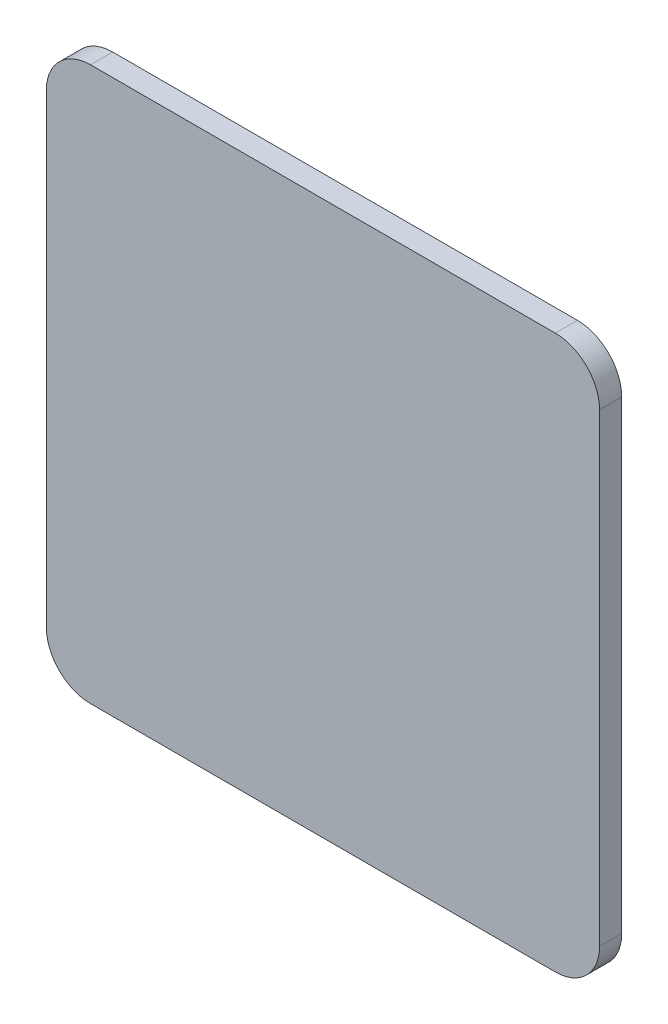
ISO-10303-21;
HEADER;
FILE_DESCRIPTION(('STEP AP214'),'2;1');
FILE_NAME('part.step','',(''),(''),'','','');
FILE_SCHEMA(('AUTOMOTIVE_DESIGN { 1 0 10303 214 1 1 1 1 }'));
ENDSEC;
DATA;
#1=APPLICATION_CONTEXT('core data for automotive mechanical design processes');
#2=APPLICATION_PROTOCOL_DEFINITION('international standard','automotive_design',2000,#1);
#3=PRODUCT_CONTEXT('',#1,'mechanical');
#4=PRODUCT('Part','Part','',(#3));
#5=PRODUCT_RELATED_PRODUCT_CATEGORY('part','',(#4));
#6=PRODUCT_DEFINITION_FORMATION('','',#4);
#7=PRODUCT_DEFINITION_CONTEXT('part definition',#1,'design');
#8=PRODUCT_DEFINITION('design','',#6,#7);
#9=PRODUCT_DEFINITION_SHAPE('','',#8);
#10=(LENGTH_UNIT() NAMED_UNIT(*) SI_UNIT(.MILLI.,.METRE.));
#11=(NAMED_UNIT(*) PLANE_ANGLE_UNIT() SI_UNIT($,.RADIAN.));
#12=(NAMED_UNIT(*) SI_UNIT($,.STERADIAN.) SOLID_ANGLE_UNIT());
#13=UNCERTAINTY_MEASURE_WITH_UNIT(LENGTH_MEASURE(1.E-05),#10,'distance_accuracy_value','');
#14=(GEOMETRIC_REPRESENTATION_CONTEXT(3) GLOBAL_UNCERTAINTY_ASSIGNED_CONTEXT((#13)) GLOBAL_UNIT_ASSIGNED_CONTEXT((#10,
#11,#12)) REPRESENTATION_CONTEXT('',''));
#15=CARTESIAN_POINT('',(0.,0.,0.));
#16=DIRECTION('',(0.,0.,1.));
#17=DIRECTION('',(1.,0.,0.));
#18=AXIS2_PLACEMENT_3D('',#15,#16,#17);
#19=CARTESIAN_POINT('',(0.,63.5,5.08));
#20=DIRECTION('',(0.,-1.,0.));
#21=DIRECTION('',(1.,0.,0.));
#22=AXIS2_PLACEMENT_3D('',#19,#20,#21);
#23=PLANE('',#22);
#24=DIRECTION('',(-1.,0.,0.));
#25=VECTOR('',#24,1.);
#26=CARTESIAN_POINT('',(0.,63.5,0.));
#27=LINE('',#26,#25);
#28=CARTESIAN_POINT('',(53.3399999999999,63.5,0.));
#29=VERTEX_POINT('',#28);
#30=CARTESIAN_POINT('',(-53.3399999999999,63.5,0.));
#31=VERTEX_POINT('',#30);
#32=EDGE_CURVE('E133',#29,#31,#27,.T.);
#33=ORIENTED_EDGE('',*,*,#32,.T.);
#34=DIRECTION('',(0.,0.,-1.));
#35=VECTOR('',#34,1.);
#36=CARTESIAN_POINT('',(-53.3399999999999,63.5,5.08));
#37=LINE('',#36,#35);
#38=CARTESIAN_POINT('',(-53.3399999999999,63.5,5.08));
#39=VERTEX_POINT('',#38);
#40=EDGE_CURVE('E11',#39,#31,#37,.T.);
#41=ORIENTED_EDGE('',*,*,#40,.F.);
#42=DIRECTION('',(-1.,0.,0.));
#43=VECTOR('',#42,1.);
#44=CARTESIAN_POINT('',(0.,63.5,5.08));
#45=LINE('',#44,#43);
#46=CARTESIAN_POINT('',(53.3399999999999,63.5,5.08));
#47=VERTEX_POINT('',#46);
#48=EDGE_CURVE('E150',#47,#39,#45,.T.);
#49=ORIENTED_EDGE('',*,*,#48,.F.);
#50=DIRECTION('',(0.,0.,-1.));
#51=VECTOR('',#50,1.);
#52=CARTESIAN_POINT('',(53.3399999999999,63.5,5.08));
#53=LINE('',#52,#51);
#54=EDGE_CURVE('E129',#47,#29,#53,.T.);
#55=ORIENTED_EDGE('',*,*,#54,.T.);
#56=EDGE_LOOP('',(#33,#41,#49,#55));
#57=FACE_BOUND('',#56,.T.);
#58=ADVANCED_FACE('F39',(#57),#23,.F.);
#59=CARTESIAN_POINT('',(-53.34,53.34,5.08));
#60=DIRECTION('',(0.,0.,-1.));
#61=DIRECTION('',(-1.,0.,0.));
#62=AXIS2_PLACEMENT_3D('',#59,#60,#61);
#63=CYLINDRICAL_SURFACE('',#62,10.16);
#64=CARTESIAN_POINT('',(-53.34,53.34,0.));
#65=DIRECTION('',(0.,0.,1.));
#66=DIRECTION('',(1.,0.,0.));
#67=AXIS2_PLACEMENT_3D('',#64,#65,#66);
#68=CIRCLE('',#67,10.16);
#69=CARTESIAN_POINT('',(-63.5,53.3399999999999,0.));
#70=VERTEX_POINT('',#69);
#71=EDGE_CURVE('E136',#31,#70,#68,.T.);
#72=ORIENTED_EDGE('',*,*,#71,.T.);
#73=DIRECTION('',(0.,0.,-1.));
#74=VECTOR('',#73,1.);
#75=CARTESIAN_POINT('',(-63.5,53.3399999999999,5.08));
#76=LINE('',#75,#74);
#77=CARTESIAN_POINT('',(-63.5,53.3399999999999,5.08));
#78=VERTEX_POINT('',#77);
#79=EDGE_CURVE('E47',#78,#70,#76,.T.);
#80=ORIENTED_EDGE('',*,*,#79,.F.);
#81=CARTESIAN_POINT('',(-53.34,53.34,5.08));
#82=DIRECTION('',(0.,0.,1.));
#83=DIRECTION('',(1.,0.,0.));
#84=AXIS2_PLACEMENT_3D('',#81,#82,#83);
#85=CIRCLE('',#84,10.16);
#86=EDGE_CURVE('E94',#39,#78,#85,.T.);
#87=ORIENTED_EDGE('',*,*,#86,.F.);
#88=ORIENTED_EDGE('',*,*,#40,.T.);
#89=EDGE_LOOP('',(#72,#80,#87,#88));
#90=FACE_BOUND('',#89,.T.);
#91=ADVANCED_FACE('F182',(#90),#63,.T.);
#92=CARTESIAN_POINT('',(-63.5,0.,5.08));
#93=DIRECTION('',(1.,0.,0.));
#94=DIRECTION('',(0.,1.,0.));
#95=AXIS2_PLACEMENT_3D('',#92,#93,#94);
#96=PLANE('',#95);
#97=DIRECTION('',(0.,-1.,0.));
#98=VECTOR('',#97,1.);
#99=CARTESIAN_POINT('',(-63.5,0.,0.));
#100=LINE('',#99,#98);
#101=CARTESIAN_POINT('',(-63.5,-53.34,0.));
#102=VERTEX_POINT('',#101);
#103=EDGE_CURVE('E138',#70,#102,#100,.T.);
#104=ORIENTED_EDGE('',*,*,#103,.T.);
#105=DIRECTION('',(0.,0.,-1.));
#106=VECTOR('',#105,1.);
#107=CARTESIAN_POINT('',(-63.5,-53.34,5.08));
#108=LINE('',#107,#106);
#109=CARTESIAN_POINT('',(-63.5,-53.34,5.08));
#110=VERTEX_POINT('',#109);
#111=EDGE_CURVE('E156',#110,#102,#108,.T.);
#112=ORIENTED_EDGE('',*,*,#111,.F.);
#113=DIRECTION('',(0.,-1.,0.));
#114=VECTOR('',#113,1.);
#115=CARTESIAN_POINT('',(-63.5,0.,5.08));
#116=LINE('',#115,#114);
#117=EDGE_CURVE('E164',#78,#110,#116,.T.);
#118=ORIENTED_EDGE('',*,*,#117,.F.);
#119=ORIENTED_EDGE('',*,*,#79,.T.);
#120=EDGE_LOOP('',(#104,#112,#118,#119));
#121=FACE_BOUND('',#120,.T.);
#122=ADVANCED_FACE('F162',(#121),#96,.F.);
#123=CARTESIAN_POINT('',(-53.34,-53.34,5.08));
#124=DIRECTION('',(0.,0.,-1.));
#125=DIRECTION('',(-1.,0.,0.));
#126=AXIS2_PLACEMENT_3D('',#123,#124,#125);
#127=CYLINDRICAL_SURFACE('',#126,10.16);
#128=CARTESIAN_POINT('',(-53.34,-53.34,0.));
#129=DIRECTION('',(0.,0.,1.));
#130=DIRECTION('',(1.,0.,0.));
#131=AXIS2_PLACEMENT_3D('',#128,#129,#130);
#132=CIRCLE('',#131,10.16);
#133=CARTESIAN_POINT('',(-53.3399999999999,-63.5,0.));
#134=VERTEX_POINT('',#133);
#135=EDGE_CURVE('E140',#102,#134,#132,.T.);
#136=ORIENTED_EDGE('',*,*,#135,.T.);
#137=DIRECTION('',(0.,0.,-1.));
#138=VECTOR('',#137,1.);
#139=CARTESIAN_POINT('',(-53.3399999999999,-63.5,5.08));
#140=LINE('',#139,#138);
#141=CARTESIAN_POINT('',(-53.3399999999999,-63.5,5.08));
#142=VERTEX_POINT('',#141);
#143=EDGE_CURVE('E154',#142,#134,#140,.T.);
#144=ORIENTED_EDGE('',*,*,#143,.F.);
#145=CARTESIAN_POINT('',(-53.34,-53.34,5.08));
#146=DIRECTION('',(0.,0.,1.));
#147=DIRECTION('',(1.,0.,0.));
#148=AXIS2_PLACEMENT_3D('',#145,#146,#147);
#149=CIRCLE('',#148,10.16);
#150=EDGE_CURVE('E174',#110,#142,#149,.T.);
#151=ORIENTED_EDGE('',*,*,#150,.F.);
#152=ORIENTED_EDGE('',*,*,#111,.T.);
#153=EDGE_LOOP('',(#136,#144,#151,#152));
#154=FACE_BOUND('',#153,.T.);
#155=ADVANCED_FACE('F172',(#154),#127,.T.);
#156=CARTESIAN_POINT('',(0.,-63.5,5.08));
#157=DIRECTION('',(0.,-1.,0.));
#158=DIRECTION('',(1.,0.,0.));
#159=AXIS2_PLACEMENT_3D('',#156,#157,#158);
#160=PLANE('',#159);
#161=DIRECTION('',(-1.,0.,0.));
#162=VECTOR('',#161,1.);
#163=CARTESIAN_POINT('',(0.,-63.5,0.));
#164=LINE('',#163,#162);
#165=CARTESIAN_POINT('',(53.3399999999999,-63.5,0.));
#166=VERTEX_POINT('',#165);
#167=EDGE_CURVE('E143',#166,#134,#164,.T.);
#168=ORIENTED_EDGE('',*,*,#167,.F.);
#169=DIRECTION('',(0.,0.,-1.));
#170=VECTOR('',#169,1.);
#171=CARTESIAN_POINT('',(53.3399999999999,-63.5,5.08));
#172=LINE('',#171,#170);
#173=CARTESIAN_POINT('',(53.3399999999999,-63.5,5.08));
#174=VERTEX_POINT('',#173);
#175=EDGE_CURVE('E125',#174,#166,#172,.T.);
#176=ORIENTED_EDGE('',*,*,#175,.F.);
#177=DIRECTION('',(-1.,0.,0.));
#178=VECTOR('',#177,1.);
#179=CARTESIAN_POINT('',(0.,-63.5,5.08));
#180=LINE('',#179,#178);
#181=EDGE_CURVE('E114',#174,#142,#180,.T.);
#182=ORIENTED_EDGE('',*,*,#181,.T.);
#183=ORIENTED_EDGE('',*,*,#143,.T.);
#184=EDGE_LOOP('',(#168,#176,#182,#183));
#185=FACE_BOUND('',#184,.T.);
#186=ADVANCED_FACE('F192',(#185),#160,.T.);
#187=CARTESIAN_POINT('',(53.34,-53.34,5.08));
#188=DIRECTION('',(0.,0.,-1.));
#189=DIRECTION('',(-1.,0.,0.));
#190=AXIS2_PLACEMENT_3D('',#187,#188,#189);
#191=CYLINDRICAL_SURFACE('',#190,10.16);
#192=CARTESIAN_POINT('',(53.34,-53.34,0.));
#193=DIRECTION('',(0.,0.,1.));
#194=DIRECTION('',(1.,0.,0.));
#195=AXIS2_PLACEMENT_3D('',#192,#193,#194);
#196=CIRCLE('',#195,10.16);
#197=CARTESIAN_POINT('',(63.5,-53.3399999999999,0.));
#198=VERTEX_POINT('',#197);
#199=EDGE_CURVE('E121',#166,#198,#196,.T.);
#200=ORIENTED_EDGE('',*,*,#199,.T.);
#201=DIRECTION('',(0.,0.,-1.));
#202=VECTOR('',#201,1.);
#203=CARTESIAN_POINT('',(63.5,-53.3399999999999,5.08));
#204=LINE('',#203,#202);
#205=CARTESIAN_POINT('',(63.5,-53.3399999999999,5.08));
#206=VERTEX_POINT('',#205);
#207=EDGE_CURVE('E118',#206,#198,#204,.T.);
#208=ORIENTED_EDGE('',*,*,#207,.F.);
#209=CARTESIAN_POINT('',(53.34,-53.34,5.08));
#210=DIRECTION('',(0.,0.,1.));
#211=DIRECTION('',(1.,0.,0.));
#212=AXIS2_PLACEMENT_3D('',#209,#210,#211);
#213=CIRCLE('',#212,10.16);
#214=EDGE_CURVE('E108',#174,#206,#213,.T.);
#215=ORIENTED_EDGE('',*,*,#214,.F.);
#216=ORIENTED_EDGE('',*,*,#175,.T.);
#217=EDGE_LOOP('',(#200,#208,#215,#216));
#218=FACE_BOUND('',#217,.T.);
#219=ADVANCED_FACE('F119',(#218),#191,.T.);
#220=CARTESIAN_POINT('',(63.5,0.,5.08));
#221=DIRECTION('',(1.,0.,0.));
#222=DIRECTION('',(0.,1.,0.));
#223=AXIS2_PLACEMENT_3D('',#220,#221,#222);
#224=PLANE('',#223);
#225=DIRECTION('',(0.,-1.,0.));
#226=VECTOR('',#225,1.);
#227=CARTESIAN_POINT('',(63.5,0.,0.));
#228=LINE('',#227,#226);
#229=CARTESIAN_POINT('',(63.5,53.3399999999999,0.));
#230=VERTEX_POINT('',#229);
#231=EDGE_CURVE('E147',#230,#198,#228,.T.);
#232=ORIENTED_EDGE('',*,*,#231,.F.);
#233=DIRECTION('',(0.,0.,-1.));
#234=VECTOR('',#233,1.);
#235=CARTESIAN_POINT('',(63.5,53.3399999999999,5.08));
#236=LINE('',#235,#234);
#237=CARTESIAN_POINT('',(63.5,53.3399999999999,5.08));
#238=VERTEX_POINT('',#237);
#239=EDGE_CURVE('E83',#238,#230,#236,.T.);
#240=ORIENTED_EDGE('',*,*,#239,.F.);
#241=DIRECTION('',(0.,-1.,0.));
#242=VECTOR('',#241,1.);
#243=CARTESIAN_POINT('',(63.5,0.,5.08));
#244=LINE('',#243,#242);
#245=EDGE_CURVE('E112',#238,#206,#244,.T.);
#246=ORIENTED_EDGE('',*,*,#245,.T.);
#247=ORIENTED_EDGE('',*,*,#207,.T.);
#248=EDGE_LOOP('',(#232,#240,#246,#247));
#249=FACE_BOUND('',#248,.T.);
#250=ADVANCED_FACE('F127',(#249),#224,.T.);
#251=CARTESIAN_POINT('',(53.34,53.34,5.08));
#252=DIRECTION('',(0.,0.,-1.));
#253=DIRECTION('',(-1.,0.,0.));
#254=AXIS2_PLACEMENT_3D('',#251,#252,#253);
#255=CYLINDRICAL_SURFACE('',#254,10.16);
#256=CARTESIAN_POINT('',(53.34,53.34,0.));
#257=DIRECTION('',(0.,0.,1.));
#258=DIRECTION('',(1.,0.,0.));
#259=AXIS2_PLACEMENT_3D('',#256,#257,#258);
#260=CIRCLE('',#259,10.16);
#261=EDGE_CURVE('E86',#230,#29,#260,.T.);
#262=ORIENTED_EDGE('',*,*,#261,.T.);
#263=ORIENTED_EDGE('',*,*,#54,.F.);
#264=CARTESIAN_POINT('',(53.34,53.34,5.08));
#265=DIRECTION('',(0.,0.,1.));
#266=DIRECTION('',(1.,0.,0.));
#267=AXIS2_PLACEMENT_3D('',#264,#265,#266);
#268=CIRCLE('',#267,10.16);
#269=EDGE_CURVE('E55',#238,#47,#268,.T.);
#270=ORIENTED_EDGE('',*,*,#269,.F.);
#271=ORIENTED_EDGE('',*,*,#239,.T.);
#272=EDGE_LOOP('',(#262,#263,#270,#271));
#273=FACE_BOUND('',#272,.T.);
#274=ADVANCED_FACE('F200',(#273),#255,.T.);
#275=CARTESIAN_POINT('',(0.,0.,5.08));
#276=DIRECTION('',(0.,0.,1.));
#277=DIRECTION('',(1.,0.,0.));
#278=AXIS2_PLACEMENT_3D('',#275,#276,#277);
#279=PLANE('',#278);
#280=ORIENTED_EDGE('',*,*,#48,.T.);
#281=ORIENTED_EDGE('',*,*,#86,.T.);
#282=ORIENTED_EDGE('',*,*,#117,.T.);
#283=ORIENTED_EDGE('',*,*,#150,.T.);
#284=ORIENTED_EDGE('',*,*,#181,.F.);
#285=ORIENTED_EDGE('',*,*,#214,.T.);
#286=ORIENTED_EDGE('',*,*,#245,.F.);
#287=ORIENTED_EDGE('',*,*,#269,.T.);
#288=EDGE_LOOP('',(#280,#281,#282,#283,#284,#285,#286,#287));
#289=FACE_BOUND('',#288,.T.);
#290=ADVANCED_FACE('F110',(#289),#279,.T.);
#291=CARTESIAN_POINT('',(0.,0.,0.));
#292=DIRECTION('',(0.,0.,1.));
#293=DIRECTION('',(1.,0.,0.));
#294=AXIS2_PLACEMENT_3D('',#291,#292,#293);
#295=PLANE('',#294);
#296=ORIENTED_EDGE('',*,*,#32,.F.);
#297=ORIENTED_EDGE('',*,*,#261,.F.);
#298=ORIENTED_EDGE('',*,*,#231,.T.);
#299=ORIENTED_EDGE('',*,*,#199,.F.);
#300=ORIENTED_EDGE('',*,*,#167,.T.);
#301=ORIENTED_EDGE('',*,*,#135,.F.);
#302=ORIENTED_EDGE('',*,*,#103,.F.);
#303=ORIENTED_EDGE('',*,*,#71,.F.);
#304=EDGE_LOOP('',(#296,#297,#298,#299,#300,#301,#302,#303));
#305=FACE_BOUND('',#304,.T.);
#306=ADVANCED_FACE('F168',(#305),#295,.F.);
#307=CLOSED_SHELL('',(#58,#91,#122,#155,#186,#219,#250,#274,#290,#306));
#308=MANIFOLD_SOLID_BREP('B2',#307);
#309=ADVANCED_BREP_SHAPE_REPRESENTATION('',(#18,#308),#14);
#310=SHAPE_DEFINITION_REPRESENTATION(#9,#309);
ENDSEC;
END-ISO-10303-21;
